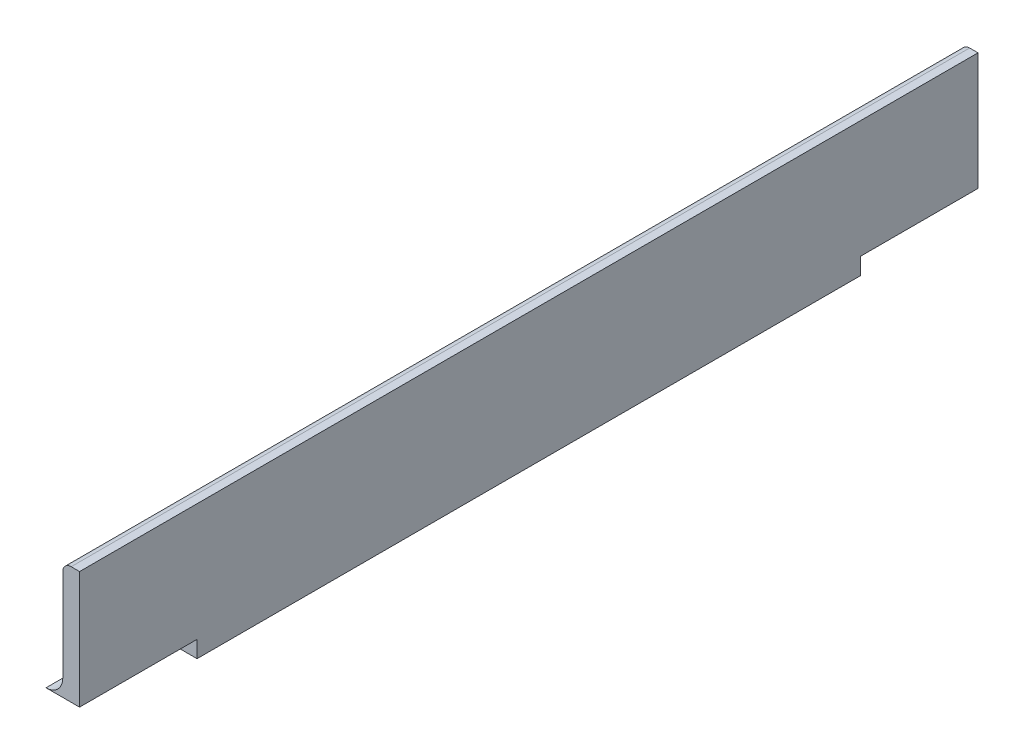
ISO-10303-21;
HEADER;
FILE_DESCRIPTION(('STEP AP214'),'2;1');
FILE_NAME('part.step','',(''),(''),'','','');
FILE_SCHEMA(('AUTOMOTIVE_DESIGN { 1 0 10303 214 1 1 1 1 }'));
ENDSEC;
DATA;
#1=APPLICATION_CONTEXT('core data for automotive mechanical design processes');
#2=APPLICATION_PROTOCOL_DEFINITION('international standard','automotive_design',2000,#1);
#3=PRODUCT_CONTEXT('',#1,'mechanical');
#4=PRODUCT('Part','Part','',(#3));
#5=PRODUCT_RELATED_PRODUCT_CATEGORY('part','',(#4));
#6=PRODUCT_DEFINITION_FORMATION('','',#4);
#7=PRODUCT_DEFINITION_CONTEXT('part definition',#1,'design');
#8=PRODUCT_DEFINITION('design','',#6,#7);
#9=PRODUCT_DEFINITION_SHAPE('','',#8);
#10=(LENGTH_UNIT() NAMED_UNIT(*) SI_UNIT(.MILLI.,.METRE.));
#11=(NAMED_UNIT(*) PLANE_ANGLE_UNIT() SI_UNIT($,.RADIAN.));
#12=(NAMED_UNIT(*) SI_UNIT($,.STERADIAN.) SOLID_ANGLE_UNIT());
#13=UNCERTAINTY_MEASURE_WITH_UNIT(LENGTH_MEASURE(1.E-05),#10,'distance_accuracy_value','');
#14=(GEOMETRIC_REPRESENTATION_CONTEXT(3) GLOBAL_UNCERTAINTY_ASSIGNED_CONTEXT((#13)) GLOBAL_UNIT_ASSIGNED_CONTEXT((#10,
#11,#12)) REPRESENTATION_CONTEXT('',''));
#15=CARTESIAN_POINT('',(0.,0.,0.));
#16=DIRECTION('',(0.,0.,1.));
#17=DIRECTION('',(1.,0.,0.));
#18=AXIS2_PLACEMENT_3D('',#15,#16,#17);
#19=CARTESIAN_POINT('',(-12.7,-11.1125,609.6));
#20=DIRECTION('',(1.,0.,0.));
#21=DIRECTION('',(0.,0.,-1.));
#22=AXIS2_PLACEMENT_3D('',#19,#20,#21);
#23=PLANE('',#22);
#24=DIRECTION('',(0.,-1.,0.));
#25=VECTOR('',#24,1.);
#26=CARTESIAN_POINT('',(-12.7,-12.7,587.37));
#27=LINE('',#26,#25);
#28=CARTESIAN_POINT('',(-12.7,-11.1125,587.37));
#29=VERTEX_POINT('',#28);
#30=CARTESIAN_POINT('',(-12.7,-12.7,587.37));
#31=VERTEX_POINT('',#30);
#32=EDGE_CURVE('E136',#29,#31,#27,.T.);
#33=ORIENTED_EDGE('',*,*,#32,.F.);
#34=DIRECTION('',(0.,0.,-1.));
#35=VECTOR('',#34,1.);
#36=CARTESIAN_POINT('',(-12.7,-11.1125,609.6));
#37=LINE('',#36,#35);
#38=CARTESIAN_POINT('',(-12.7,-11.1125,461.83));
#39=VERTEX_POINT('',#38);
#40=EDGE_CURVE('E196',#29,#39,#37,.T.);
#41=ORIENTED_EDGE('',*,*,#40,.T.);
#42=DIRECTION('',(0.,1.,0.));
#43=VECTOR('',#42,1.);
#44=CARTESIAN_POINT('',(-12.7,-12.6999999999999,461.83));
#45=LINE('',#44,#43);
#46=CARTESIAN_POINT('',(-12.7,-12.6999999999999,461.83));
#47=VERTEX_POINT('',#46);
#48=EDGE_CURVE('E162',#47,#39,#45,.T.);
#49=ORIENTED_EDGE('',*,*,#48,.F.);
#50=DIRECTION('',(0.,0.,-1.));
#51=VECTOR('',#50,1.);
#52=CARTESIAN_POINT('',(-12.7,-12.7,609.6));
#53=LINE('',#52,#51);
#54=EDGE_CURVE('E216',#31,#47,#53,.T.);
#55=ORIENTED_EDGE('',*,*,#54,.F.);
#56=EDGE_LOOP('',(#33,#41,#49,#55));
#57=FACE_BOUND('',#56,.T.);
#58=ADVANCED_FACE('F43',(#57),#23,.F.);
#59=CARTESIAN_POINT('',(-12.7,-12.7,609.6));
#60=DIRECTION('',(0.,1.,0.));
#61=DIRECTION('',(-1.,0.,0.));
#62=AXIS2_PLACEMENT_3D('',#59,#60,#61);
#63=PLANE('',#62);
#64=DIRECTION('',(1.,0.,0.));
#65=VECTOR('',#64,1.);
#66=CARTESIAN_POINT('',(12.7,-12.7,587.37));
#67=LINE('',#66,#65);
#68=CARTESIAN_POINT('',(12.7,-12.7,587.37));
#69=VERTEX_POINT('',#68);
#70=EDGE_CURVE('E143',#31,#69,#67,.T.);
#71=ORIENTED_EDGE('',*,*,#70,.F.);
#72=ORIENTED_EDGE('',*,*,#54,.T.);
#73=DIRECTION('',(-1.,0.,0.));
#74=VECTOR('',#73,1.);
#75=CARTESIAN_POINT('',(12.7,-12.6999999999999,461.83));
#76=LINE('',#75,#74);
#77=CARTESIAN_POINT('',(12.7,-12.6999999999999,461.83));
#78=VERTEX_POINT('',#77);
#79=EDGE_CURVE('E155',#78,#47,#76,.T.);
#80=ORIENTED_EDGE('',*,*,#79,.F.);
#81=DIRECTION('',(0.,0.,-1.));
#82=VECTOR('',#81,1.);
#83=CARTESIAN_POINT('',(12.7,-12.7,609.6));
#84=LINE('',#83,#82);
#85=EDGE_CURVE('E214',#69,#78,#84,.T.);
#86=ORIENTED_EDGE('',*,*,#85,.F.);
#87=EDGE_LOOP('',(#71,#72,#80,#86));
#88=FACE_BOUND('',#87,.T.);
#89=ADVANCED_FACE('F243',(#88),#63,.F.);
#90=CARTESIAN_POINT('',(6.35,-9.525,609.6));
#91=DIRECTION('',(0.,-1.,0.));
#92=DIRECTION('',(1.,0.,0.));
#93=AXIS2_PLACEMENT_3D('',#90,#91,#92);
#94=PLANE('',#93);
#95=DIRECTION('',(-1.,0.,0.));
#96=VECTOR('',#95,1.);
#97=CARTESIAN_POINT('',(12.7,-9.525,587.37));
#98=LINE('',#97,#96);
#99=CARTESIAN_POINT('',(6.35,-9.525,587.37));
#100=VERTEX_POINT('',#99);
#101=CARTESIAN_POINT('',(-11.1125,-9.525,587.37));
#102=VERTEX_POINT('',#101);
#103=EDGE_CURVE('E137',#100,#102,#98,.T.);
#104=ORIENTED_EDGE('',*,*,#103,.F.);
#105=DIRECTION('',(0.,0.,-1.));
#106=VECTOR('',#105,1.);
#107=CARTESIAN_POINT('',(6.35,-9.525,609.6));
#108=LINE('',#107,#106);
#109=CARTESIAN_POINT('',(6.35,-9.5249999999999,461.83));
#110=VERTEX_POINT('',#109);
#111=EDGE_CURVE('E200',#100,#110,#108,.T.);
#112=ORIENTED_EDGE('',*,*,#111,.T.);
#113=DIRECTION('',(1.,0.,0.));
#114=VECTOR('',#113,1.);
#115=CARTESIAN_POINT('',(12.7,-9.5249999999999,461.83));
#116=LINE('',#115,#114);
#117=CARTESIAN_POINT('',(-11.1125,-9.5249999999999,461.83));
#118=VERTEX_POINT('',#117);
#119=EDGE_CURVE('E167',#118,#110,#116,.T.);
#120=ORIENTED_EDGE('',*,*,#119,.F.);
#121=DIRECTION('',(0.,0.,-1.));
#122=VECTOR('',#121,1.);
#123=CARTESIAN_POINT('',(-11.1125,-9.525,609.6));
#124=LINE('',#123,#122);
#125=EDGE_CURVE('E198',#102,#118,#124,.T.);
#126=ORIENTED_EDGE('',*,*,#125,.F.);
#127=EDGE_LOOP('',(#104,#112,#120,#126));
#128=FACE_BOUND('',#127,.T.);
#129=ADVANCED_FACE('F233',(#128),#94,.F.);
#130=CARTESIAN_POINT('',(-11.1125,-11.1125,609.6));
#131=DIRECTION('',(0.,0.,-1.));
#132=DIRECTION('',(-1.,0.,0.));
#133=AXIS2_PLACEMENT_3D('',#130,#131,#132);
#134=CYLINDRICAL_SURFACE('',#133,1.5875);
#135=CARTESIAN_POINT('',(-11.1125,-11.1125,587.37));
#136=DIRECTION('',(0.,0.,1.));
#137=DIRECTION('',(1.,0.,0.));
#138=AXIS2_PLACEMENT_3D('',#135,#136,#137);
#139=CIRCLE('',#138,1.5875);
#140=EDGE_CURVE('E12',#102,#29,#139,.T.);
#141=ORIENTED_EDGE('',*,*,#140,.F.);
#142=ORIENTED_EDGE('',*,*,#125,.T.);
#143=CARTESIAN_POINT('',(-11.1125,-11.1125,461.83));
#144=DIRECTION('',(0.,0.,1.));
#145=DIRECTION('',(1.,0.,0.));
#146=AXIS2_PLACEMENT_3D('',#143,#144,#145);
#147=CIRCLE('',#146,1.5875);
#148=EDGE_CURVE('E50',#118,#39,#147,.T.);
#149=ORIENTED_EDGE('',*,*,#148,.T.);
#150=ORIENTED_EDGE('',*,*,#40,.F.);
#151=EDGE_LOOP('',(#141,#142,#149,#150));
#152=FACE_BOUND('',#151,.T.);
#153=ADVANCED_FACE('F225',(#152),#134,.T.);
#154=CARTESIAN_POINT('',(12.7,-12.7,609.6));
#155=DIRECTION('',(-1.,0.,0.));
#156=DIRECTION('',(0.,-1.,0.));
#157=AXIS2_PLACEMENT_3D('',#154,#155,#156);
#158=PLANE('',#157);
#159=DIRECTION('',(0.,1.,0.));
#160=VECTOR('',#159,1.);
#161=CARTESIAN_POINT('',(12.7,-12.7,609.6));
#162=LINE('',#161,#160);
#163=CARTESIAN_POINT('',(12.7,-9.525,609.6));
#164=VERTEX_POINT('',#163);
#165=CARTESIAN_POINT('',(12.7,12.7,609.6));
#166=VERTEX_POINT('',#165);
#167=EDGE_CURVE('E151',#164,#166,#162,.T.);
#168=ORIENTED_EDGE('',*,*,#167,.F.);
#169=DIRECTION('',(0.,0.,1.));
#170=VECTOR('',#169,1.);
#171=CARTESIAN_POINT('',(12.7,-9.525,587.37));
#172=LINE('',#171,#170);
#173=CARTESIAN_POINT('',(12.7,-9.525,587.37));
#174=VERTEX_POINT('',#173);
#175=EDGE_CURVE('E57',#174,#164,#172,.T.);
#176=ORIENTED_EDGE('',*,*,#175,.F.);
#177=DIRECTION('',(0.,1.,0.));
#178=VECTOR('',#177,1.);
#179=CARTESIAN_POINT('',(12.7,-12.7,587.37));
#180=LINE('',#179,#178);
#181=EDGE_CURVE('E140',#69,#174,#180,.T.);
#182=ORIENTED_EDGE('',*,*,#181,.F.);
#183=ORIENTED_EDGE('',*,*,#85,.T.);
#184=DIRECTION('',(0.,-1.,0.));
#185=VECTOR('',#184,1.);
#186=CARTESIAN_POINT('',(12.7,-12.6999999999999,461.83));
#187=LINE('',#186,#185);
#188=CARTESIAN_POINT('',(12.7,-9.5249999999999,461.83));
#189=VERTEX_POINT('',#188);
#190=EDGE_CURVE('E152',#189,#78,#187,.T.);
#191=ORIENTED_EDGE('',*,*,#190,.F.);
#192=DIRECTION('',(0.,0.,-1.));
#193=VECTOR('',#192,1.);
#194=CARTESIAN_POINT('',(12.7,-9.5249999999999,461.83));
#195=LINE('',#194,#193);
#196=CARTESIAN_POINT('',(12.7,-9.525,439.6));
#197=VERTEX_POINT('',#196);
#198=EDGE_CURVE('E168',#189,#197,#195,.T.);
#199=ORIENTED_EDGE('',*,*,#198,.T.);
#200=DIRECTION('',(0.,-1.,0.));
#201=VECTOR('',#200,1.);
#202=CARTESIAN_POINT('',(12.7,12.6999999999999,439.6));
#203=LINE('',#202,#201);
#204=CARTESIAN_POINT('',(12.7,12.6999999999999,439.6));
#205=VERTEX_POINT('',#204);
#206=EDGE_CURVE('E174',#205,#197,#203,.T.);
#207=ORIENTED_EDGE('',*,*,#206,.F.);
#208=DIRECTION('',(0.,0.,-1.));
#209=VECTOR('',#208,1.);
#210=CARTESIAN_POINT('',(12.7,12.7,609.6));
#211=LINE('',#210,#209);
#212=EDGE_CURVE('E211',#166,#205,#211,.T.);
#213=ORIENTED_EDGE('',*,*,#212,.F.);
#214=EDGE_LOOP('',(#168,#176,#182,#183,#191,#199,#207,#213));
#215=FACE_BOUND('',#214,.T.);
#216=ADVANCED_FACE('F149',(#215),#158,.F.);
#217=CARTESIAN_POINT('',(11.1125,12.7,609.6));
#218=DIRECTION('',(0.,-1.,0.));
#219=DIRECTION('',(0.,0.,-1.));
#220=AXIS2_PLACEMENT_3D('',#217,#218,#219);
#221=PLANE('',#220);
#222=ORIENTED_EDGE('',*,*,#212,.T.);
#223=DIRECTION('',(1.,0.,0.));
#224=VECTOR('',#223,1.);
#225=CARTESIAN_POINT('',(-17.78,12.6999999999999,439.6));
#226=LINE('',#225,#224);
#227=CARTESIAN_POINT('',(11.1125,12.6999999999999,439.6));
#228=VERTEX_POINT('',#227);
#229=EDGE_CURVE('E177',#228,#205,#226,.T.);
#230=ORIENTED_EDGE('',*,*,#229,.F.);
#231=DIRECTION('',(0.,0.,-1.));
#232=VECTOR('',#231,1.);
#233=CARTESIAN_POINT('',(11.1125,12.7,609.6));
#234=LINE('',#233,#232);
#235=CARTESIAN_POINT('',(11.1125,12.7,609.6));
#236=VERTEX_POINT('',#235);
#237=EDGE_CURVE('E208',#236,#228,#234,.T.);
#238=ORIENTED_EDGE('',*,*,#237,.F.);
#239=DIRECTION('',(-1.,0.,0.));
#240=VECTOR('',#239,1.);
#241=CARTESIAN_POINT('',(11.1125,12.7,609.6));
#242=LINE('',#241,#240);
#243=EDGE_CURVE('E189',#166,#236,#242,.T.);
#244=ORIENTED_EDGE('',*,*,#243,.F.);
#245=EDGE_LOOP('',(#222,#230,#238,#244));
#246=FACE_BOUND('',#245,.T.);
#247=ADVANCED_FACE('F260',(#246),#221,.F.);
#248=CARTESIAN_POINT('',(11.1125,11.1125,609.6));
#249=DIRECTION('',(0.,0.,-1.));
#250=DIRECTION('',(-1.,0.,0.));
#251=AXIS2_PLACEMENT_3D('',#248,#249,#250);
#252=CYLINDRICAL_SURFACE('',#251,1.5875);
#253=ORIENTED_EDGE('',*,*,#237,.T.);
#254=CARTESIAN_POINT('',(11.1125,11.1125,439.6));
#255=DIRECTION('',(0.,0.,1.));
#256=DIRECTION('',(0.,-1.,0.));
#257=AXIS2_PLACEMENT_3D('',#254,#255,#256);
#258=CIRCLE('',#257,1.5875);
#259=CARTESIAN_POINT('',(9.525,11.1125,439.6));
#260=VERTEX_POINT('',#259);
#261=EDGE_CURVE('E185',#228,#260,#258,.T.);
#262=ORIENTED_EDGE('',*,*,#261,.T.);
#263=DIRECTION('',(0.,0.,-1.));
#264=VECTOR('',#263,1.);
#265=CARTESIAN_POINT('',(9.525,11.1125,609.6));
#266=LINE('',#265,#264);
#267=CARTESIAN_POINT('',(9.525,11.1125,609.6));
#268=VERTEX_POINT('',#267);
#269=EDGE_CURVE('E205',#268,#260,#266,.T.);
#270=ORIENTED_EDGE('',*,*,#269,.F.);
#271=CARTESIAN_POINT('',(11.1125,11.1125,609.6));
#272=DIRECTION('',(0.,0.,1.));
#273=DIRECTION('',(-1.,0.,0.));
#274=AXIS2_PLACEMENT_3D('',#271,#272,#273);
#275=CIRCLE('',#274,1.5875);
#276=EDGE_CURVE('E191',#236,#268,#275,.T.);
#277=ORIENTED_EDGE('',*,*,#276,.F.);
#278=EDGE_LOOP('',(#253,#262,#270,#277));
#279=FACE_BOUND('',#278,.T.);
#280=ADVANCED_FACE('F263',(#279),#252,.T.);
#281=CARTESIAN_POINT('',(9.525,11.1125,609.6));
#282=DIRECTION('',(1.,0.,0.));
#283=DIRECTION('',(0.,1.,0.));
#284=AXIS2_PLACEMENT_3D('',#281,#282,#283);
#285=PLANE('',#284);
#286=ORIENTED_EDGE('',*,*,#269,.T.);
#287=DIRECTION('',(0.,-1.,0.));
#288=VECTOR('',#287,1.);
#289=CARTESIAN_POINT('',(9.525,11.1124999999993,439.6));
#290=LINE('',#289,#288);
#291=CARTESIAN_POINT('',(9.525,-6.35,439.6));
#292=VERTEX_POINT('',#291);
#293=EDGE_CURVE('E182',#260,#292,#290,.T.);
#294=ORIENTED_EDGE('',*,*,#293,.T.);
#295=DIRECTION('',(0.,0.,-1.));
#296=VECTOR('',#295,1.);
#297=CARTESIAN_POINT('',(9.525,-6.35,609.6));
#298=LINE('',#297,#296);
#299=CARTESIAN_POINT('',(9.525,-6.35,609.6));
#300=VERTEX_POINT('',#299);
#301=EDGE_CURVE('E202',#300,#292,#298,.T.);
#302=ORIENTED_EDGE('',*,*,#301,.F.);
#303=DIRECTION('',(0.,-1.,0.));
#304=VECTOR('',#303,1.);
#305=CARTESIAN_POINT('',(9.525,11.1125,609.6));
#306=LINE('',#305,#304);
#307=EDGE_CURVE('E65',#268,#300,#306,.T.);
#308=ORIENTED_EDGE('',*,*,#307,.F.);
#309=EDGE_LOOP('',(#286,#294,#302,#308));
#310=FACE_BOUND('',#309,.T.);
#311=ADVANCED_FACE('F267',(#310),#285,.F.);
#312=CARTESIAN_POINT('',(6.35,-6.35,609.6));
#313=DIRECTION('',(0.,0.,-1.));
#314=DIRECTION('',(-1.,0.,0.));
#315=AXIS2_PLACEMENT_3D('',#312,#313,#314);
#316=CYLINDRICAL_SURFACE('',#315,3.175);
#317=ORIENTED_EDGE('',*,*,#301,.T.);
#318=CARTESIAN_POINT('',(6.35,-6.35,439.6));
#319=DIRECTION('',(0.,0.,1.));
#320=DIRECTION('',(0.,-1.,0.));
#321=AXIS2_PLACEMENT_3D('',#318,#319,#320);
#322=CIRCLE('',#321,3.175);
#323=CARTESIAN_POINT('',(6.35,-9.525,439.6));
#324=VERTEX_POINT('',#323);
#325=EDGE_CURVE('E179',#292,#324,#322,.F.);
#326=ORIENTED_EDGE('',*,*,#325,.T.);
#327=DIRECTION('',(0.,0.,-1.));
#328=VECTOR('',#327,1.);
#329=CARTESIAN_POINT('',(6.35,-9.52499999999963,609.6));
#330=LINE('',#329,#328);
#331=EDGE_CURVE('E171',#324,#110,#330,.F.);
#332=ORIENTED_EDGE('',*,*,#331,.T.);
#333=ORIENTED_EDGE('',*,*,#111,.F.);
#334=CARTESIAN_POINT('',(6.35,-9.525,609.6));
#335=VERTEX_POINT('',#334);
#336=EDGE_CURVE('E133',#335,#100,#108,.T.);
#337=ORIENTED_EDGE('',*,*,#336,.F.);
#338=CARTESIAN_POINT('',(6.35,-6.35,609.6));
#339=DIRECTION('',(0.,0.,-1.));
#340=DIRECTION('',(-1.,0.,0.));
#341=AXIS2_PLACEMENT_3D('',#338,#339,#340);
#342=CIRCLE('',#341,3.175);
#343=EDGE_CURVE('E194',#300,#335,#342,.T.);
#344=ORIENTED_EDGE('',*,*,#343,.F.);
#345=EDGE_LOOP('',(#317,#326,#332,#333,#337,#344));
#346=FACE_BOUND('',#345,.T.);
#347=ADVANCED_FACE('F271',(#346),#316,.F.);
#348=CARTESIAN_POINT('',(11.1125,11.1125,609.6));
#349=DIRECTION('',(0.,0.,-1.));
#350=DIRECTION('',(-1.,0.,0.));
#351=AXIS2_PLACEMENT_3D('',#348,#349,#350);
#352=PLANE('',#351);
#353=ORIENTED_EDGE('',*,*,#343,.T.);
#354=DIRECTION('',(-1.,0.,0.));
#355=VECTOR('',#354,1.);
#356=CARTESIAN_POINT('',(12.7,-9.525,609.6));
#357=LINE('',#356,#355);
#358=EDGE_CURVE('E146',#164,#335,#357,.T.);
#359=ORIENTED_EDGE('',*,*,#358,.F.);
#360=ORIENTED_EDGE('',*,*,#167,.T.);
#361=ORIENTED_EDGE('',*,*,#243,.T.);
#362=ORIENTED_EDGE('',*,*,#276,.T.);
#363=ORIENTED_EDGE('',*,*,#307,.T.);
#364=EDGE_LOOP('',(#353,#359,#360,#361,#362,#363));
#365=FACE_BOUND('',#364,.T.);
#366=ADVANCED_FACE('F274',(#365),#352,.F.);
#367=CARTESIAN_POINT('',(-17.78,12.6999999999999,439.6));
#368=DIRECTION('',(0.,0.,1.));
#369=DIRECTION('',(0.,-1.,0.));
#370=AXIS2_PLACEMENT_3D('',#367,#368,#369);
#371=PLANE('',#370);
#372=ORIENTED_EDGE('',*,*,#206,.T.);
#373=DIRECTION('',(-1.,0.,0.));
#374=VECTOR('',#373,1.);
#375=CARTESIAN_POINT('',(-17.78,-9.525,439.6));
#376=LINE('',#375,#374);
#377=EDGE_CURVE('E218',#197,#324,#376,.T.);
#378=ORIENTED_EDGE('',*,*,#377,.T.);
#379=ORIENTED_EDGE('',*,*,#325,.F.);
#380=ORIENTED_EDGE('',*,*,#293,.F.);
#381=ORIENTED_EDGE('',*,*,#261,.F.);
#382=ORIENTED_EDGE('',*,*,#229,.T.);
#383=EDGE_LOOP('',(#372,#378,#379,#380,#381,#382));
#384=FACE_BOUND('',#383,.T.);
#385=ADVANCED_FACE('F280',(#384),#371,.F.);
#386=CARTESIAN_POINT('',(0.,0.,461.83));
#387=DIRECTION('',(0.,0.,1.));
#388=DIRECTION('',(1.,0.,0.));
#389=AXIS2_PLACEMENT_3D('',#386,#387,#388);
#390=PLANE('',#389);
#391=ORIENTED_EDGE('',*,*,#119,.T.);
#392=EDGE_CURVE('E165',#110,#189,#116,.T.);
#393=ORIENTED_EDGE('',*,*,#392,.T.);
#394=ORIENTED_EDGE('',*,*,#190,.T.);
#395=ORIENTED_EDGE('',*,*,#79,.T.);
#396=ORIENTED_EDGE('',*,*,#48,.T.);
#397=ORIENTED_EDGE('',*,*,#148,.F.);
#398=EDGE_LOOP('',(#391,#393,#394,#395,#396,#397));
#399=FACE_BOUND('',#398,.T.);
#400=ADVANCED_FACE('F230',(#399),#390,.F.);
#401=CARTESIAN_POINT('',(12.7,-9.5249999999999,461.83));
#402=DIRECTION('',(0.,1.,0.));
#403=DIRECTION('',(0.,0.,1.));
#404=AXIS2_PLACEMENT_3D('',#401,#402,#403);
#405=PLANE('',#404);
#406=ORIENTED_EDGE('',*,*,#377,.F.);
#407=ORIENTED_EDGE('',*,*,#198,.F.);
#408=ORIENTED_EDGE('',*,*,#392,.F.);
#409=ORIENTED_EDGE('',*,*,#331,.F.);
#410=EDGE_LOOP('',(#406,#407,#408,#409));
#411=FACE_BOUND('',#410,.T.);
#412=ADVANCED_FACE('F239',(#411),#405,.F.);
#413=CARTESIAN_POINT('',(0.,0.,587.37));
#414=DIRECTION('',(0.,0.,1.));
#415=DIRECTION('',(1.,0.,0.));
#416=AXIS2_PLACEMENT_3D('',#413,#414,#415);
#417=PLANE('',#416);
#418=ORIENTED_EDGE('',*,*,#140,.T.);
#419=ORIENTED_EDGE('',*,*,#32,.T.);
#420=ORIENTED_EDGE('',*,*,#70,.T.);
#421=ORIENTED_EDGE('',*,*,#181,.T.);
#422=EDGE_CURVE('E129',#174,#100,#98,.T.);
#423=ORIENTED_EDGE('',*,*,#422,.T.);
#424=ORIENTED_EDGE('',*,*,#103,.T.);
#425=EDGE_LOOP('',(#418,#419,#420,#421,#423,#424));
#426=FACE_BOUND('',#425,.T.);
#427=ADVANCED_FACE('F141',(#426),#417,.T.);
#428=CARTESIAN_POINT('',(12.7,-9.525,587.37));
#429=DIRECTION('',(0.,1.,0.));
#430=DIRECTION('',(-1.,0.,0.));
#431=AXIS2_PLACEMENT_3D('',#428,#429,#430);
#432=PLANE('',#431);
#433=ORIENTED_EDGE('',*,*,#422,.F.);
#434=ORIENTED_EDGE('',*,*,#175,.T.);
#435=ORIENTED_EDGE('',*,*,#358,.T.);
#436=ORIENTED_EDGE('',*,*,#336,.T.);
#437=EDGE_LOOP('',(#433,#434,#435,#436));
#438=FACE_BOUND('',#437,.T.);
#439=ADVANCED_FACE('F131',(#438),#432,.F.);
#440=CLOSED_SHELL('',(#58,#89,#129,#153,#216,#247,#280,#311,#347,#366,#385,#400,#412,#427,#439));
#441=MANIFOLD_SOLID_BREP('B2',#440);
#442=ADVANCED_BREP_SHAPE_REPRESENTATION('',(#18,#441),#14);
#443=SHAPE_DEFINITION_REPRESENTATION(#9,#442);
ENDSEC;
END-ISO-10303-21;
